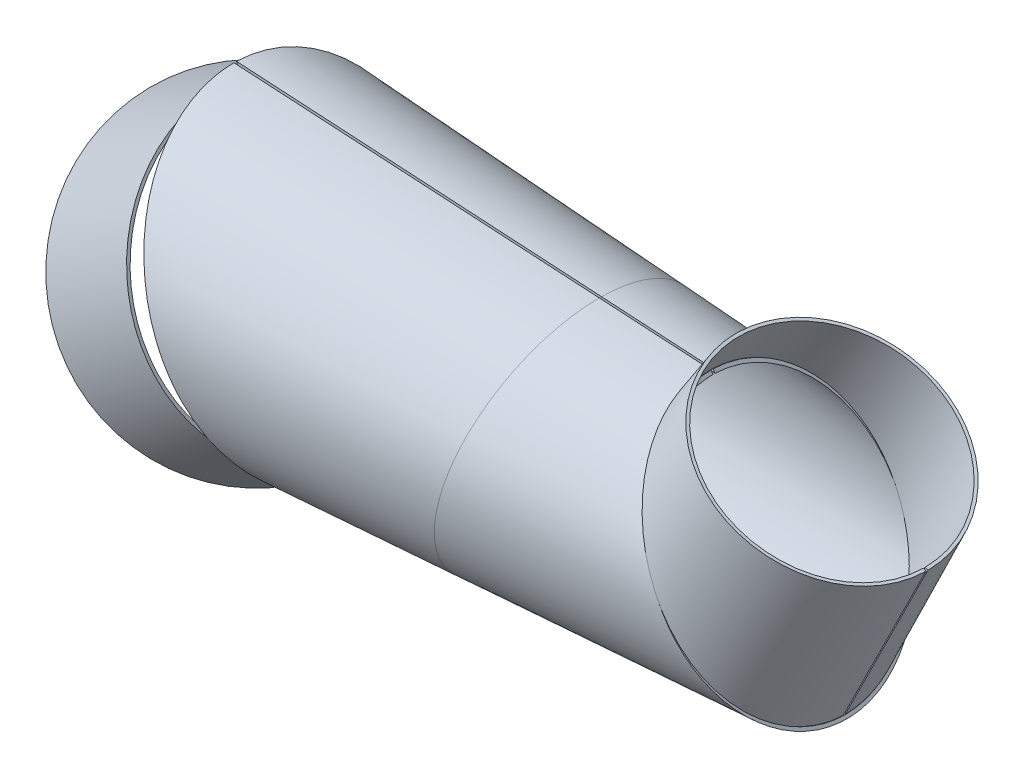
ISO-10303-21;
HEADER;
FILE_DESCRIPTION(('STEP AP214'),'2;1');
FILE_NAME('part.step','',(''),(''),'','','');
FILE_SCHEMA(('AUTOMOTIVE_DESIGN { 1 0 10303 214 1 1 1 1 }'));
ENDSEC;
DATA;
#1=APPLICATION_CONTEXT('core data for automotive mechanical design processes');
#2=APPLICATION_PROTOCOL_DEFINITION('international standard','automotive_design',2000,#1);
#3=PRODUCT_CONTEXT('',#1,'mechanical');
#4=PRODUCT('Part','Part','',(#3));
#5=PRODUCT_RELATED_PRODUCT_CATEGORY('part','',(#4));
#6=PRODUCT_DEFINITION_FORMATION('','',#4);
#7=PRODUCT_DEFINITION_CONTEXT('part definition',#1,'design');
#8=PRODUCT_DEFINITION('design','',#6,#7);
#9=PRODUCT_DEFINITION_SHAPE('','',#8);
#10=(LENGTH_UNIT() NAMED_UNIT(*) SI_UNIT(.MILLI.,.METRE.));
#11=(NAMED_UNIT(*) PLANE_ANGLE_UNIT() SI_UNIT($,.RADIAN.));
#12=(NAMED_UNIT(*) SI_UNIT($,.STERADIAN.) SOLID_ANGLE_UNIT());
#13=UNCERTAINTY_MEASURE_WITH_UNIT(LENGTH_MEASURE(1.E-05),#10,'distance_accuracy_value','');
#14=(GEOMETRIC_REPRESENTATION_CONTEXT(3) GLOBAL_UNCERTAINTY_ASSIGNED_CONTEXT((#13)) GLOBAL_UNIT_ASSIGNED_CONTEXT((#10,
#11,#12)) REPRESENTATION_CONTEXT('',''));
#15=CARTESIAN_POINT('',(0.,0.,0.));
#16=DIRECTION('',(0.,0.,1.));
#17=DIRECTION('',(1.,0.,0.));
#18=AXIS2_PLACEMENT_3D('',#15,#16,#17);
#19=CARTESIAN_POINT('',(252.873344655252,-83.6017692647492,51.3013428607681));
#20=DIRECTION('',(-0.864782222533659,-0.502147097561806,0.));
#21=DIRECTION('',(-0.502147097561806,0.864782222533659,0.));
#22=AXIS2_PLACEMENT_3D('',#19,#20,#21);
#23=PLANE('',#22);
#24=CARTESIAN_POINT('',(202.952192873016,2.37089651247027,-0.0407028410811309));
#25=DIRECTION('',(-0.864782222533659,-0.502147097561806,0.));
#26=DIRECTION('',(0.502147097561806,-0.864782222533659,0.));
#27=AXIS2_PLACEMENT_3D('',#24,#25,#26);
#28=ELLIPSE('',#27,45.8155439953162,39.598352100711);
#29=CARTESIAN_POINT('',(225.958335313478,-37.249571450388,-0.0407028410809806));
#30=VERTEX_POINT('',#29);
#31=CARTESIAN_POINT('',(225.954589177034,-37.2431199699031,0.673866410739601));
#32=VERTEX_POINT('',#31);
#33=EDGE_CURVE('E51',#30,#32,#28,.F.);
#34=ORIENTED_EDGE('',*,*,#33,.F.);
#35=DIRECTION('',(-0.502147097561806,0.864782222533659,0.));
#36=VECTOR('',#35,1.);
#37=CARTESIAN_POINT('',(275.786796245424,-123.062607908006,-0.0407028410806813));
#38=LINE('',#37,#36);
#39=CARTESIAN_POINT('',(225.356609741523,-36.2132982547497,-0.0407028410809841));
#40=VERTEX_POINT('',#39);
#41=EDGE_CURVE('E96',#40,#30,#38,.F.);
#42=ORIENTED_EDGE('',*,*,#41,.F.);
#43=CARTESIAN_POINT('',(202.932740468235,2.4043968431928,-0.0407028410811306));
#44=DIRECTION('',(-0.864782222533659,-0.502147097561806,0.));
#45=DIRECTION('',(0.502147097561806,-0.864782222533659,0.));
#46=AXIS2_PLACEMENT_3D('',#43,#44,#45);
#47=ELLIPSE('',#46,44.6559770676124,38.5961389764437);
#48=CARTESIAN_POINT('',(225.352958417789,-36.2070100577861,0.655781044950861));
#49=VERTEX_POINT('',#48);
#50=EDGE_CURVE('E12',#40,#49,#47,.F.);
#51=ORIENTED_EDGE('',*,*,#50,.T.);
#52=DIRECTION('',(0.502089899252001,-0.864683717371092,0.0150931104290657));
#53=VECTOR('',#52,1.);
#54=CARTESIAN_POINT('',(208.413205270931,-7.03389037504484,0.146562346730605));
#55=LINE('',#54,#53);
#56=EDGE_CURVE('E56',#32,#49,#55,.F.);
#57=ORIENTED_EDGE('',*,*,#56,.F.);
#58=EDGE_LOOP('',(#34,#42,#51,#57));
#59=FACE_BOUND('',#58,.T.);
#60=ADVANCED_FACE('F48',(#59),#23,.T.);
#61=CARTESIAN_POINT('',(253.388914419697,19.0897985581255,0.602345329373929));
#62=DIRECTION('',(-0.0151573410996609,0.00865109826784784,0.999847695156392));
#63=DIRECTION('',(-0.445000523184025,-0.895529747955005,0.00100244380895949));
#64=AXIS2_PLACEMENT_3D('',#61,#62,#63);
#65=PLANE('',#64);
#66=DIRECTION('',(-0.445000523184025,-0.895529747955005,0.00100244380895948));
#67=VECTOR('',#66,1.);
#68=CARTESIAN_POINT('',(-2709.11829160772,-5943.85432651848,7.28564658828967));
#69=LINE('',#68,#67);
#70=CARTESIAN_POINT('',(253.836615433035,18.8673397815923,0.611057125928902));
#71=VERTEX_POINT('',#70);
#72=EDGE_CURVE('E99',#71,#32,#69,.T.);
#73=ORIENTED_EDGE('',*,*,#72,.T.);
#74=ORIENTED_EDGE('',*,*,#56,.T.);
#75=DIRECTION('',(-0.445000523184025,-0.895529747955005,0.00100244380895948));
#76=VECTOR('',#75,1.);
#77=CARTESIAN_POINT('',(-2710.0136936344,-5943.40940896541,7.26822299517971));
#78=LINE('',#77,#76);
#79=CARTESIAN_POINT('',(252.941213406358,19.3122573346585,0.593633532818945));
#80=VERTEX_POINT('',#79);
#81=EDGE_CURVE('E72',#80,#49,#78,.T.);
#82=ORIENTED_EDGE('',*,*,#81,.F.);
#83=DIRECTION('',(0.895402026676695,-0.444917553066189,0.0174235931099559));
#84=VECTOR('',#83,1.);
#85=CARTESIAN_POINT('',(253.388914419697,19.0897985581255,0.602345329373923));
#86=LINE('',#85,#84);
#87=EDGE_CURVE('E106',#80,#71,#86,.T.);
#88=ORIENTED_EDGE('',*,*,#87,.T.);
#89=EDGE_LOOP('',(#73,#74,#82,#88));
#90=FACE_BOUND('',#89,.T.);
#91=ADVANCED_FACE('F120',(#90),#65,.F.);
#92=CARTESIAN_POINT('',(221.393352343052,37.3513623667278,-0.0407028410809843));
#93=DIRECTION('',(0.495696584820509,0.868495766136648,0.));
#94=DIRECTION('',(0.,0.,1.));
#95=AXIS2_PLACEMENT_3D('',#92,#93,#94);
#96=CONICAL_SURFACE('',#95,36.8458168085013,1.51332598057206);
#97=ORIENTED_EDGE('',*,*,#87,.F.);
#98=CARTESIAN_POINT('',(221.379116255485,37.3264197260952,-0.0407028410809845));
#99=DIRECTION('',(-0.495696584820509,-0.868495766136648,0.));
#100=DIRECTION('',(0.,0.,-1.));
#101=AXIS2_PLACEMENT_3D('',#98,#99,#100);
#102=CIRCLE('',#101,36.3466422914344);
#103=CARTESIAN_POINT('',(252.946021198879,19.3095132725385,-0.040702841080782));
#104=VERTEX_POINT('',#103);
#105=EDGE_CURVE('E105',#104,#80,#102,.F.);
#106=ORIENTED_EDGE('',*,*,#105,.F.);
#107=DIRECTION('',(0.895534084405186,-0.444992925414063,0.));
#108=VECTOR('',#107,1.);
#109=CARTESIAN_POINT('',(253.393788241081,19.0870168098315,-0.0407028410807792));
#110=LINE('',#109,#108);
#111=CARTESIAN_POINT('',(253.841555283284,18.8645203471244,-0.0407028410807763));
#112=VERTEX_POINT('',#111);
#113=EDGE_CURVE('E94',#104,#112,#110,.T.);
#114=ORIENTED_EDGE('',*,*,#113,.T.);
#115=CARTESIAN_POINT('',(221.407588430618,37.3763050073604,-0.0407028410809843));
#116=DIRECTION('',(-0.495696584820509,-0.868495766136648,0.));
#117=DIRECTION('',(0.,0.,-1.));
#118=AXIS2_PLACEMENT_3D('',#115,#116,#117);
#119=CIRCLE('',#118,37.3449913255684);
#120=EDGE_CURVE('E104',#112,#71,#119,.F.);
#121=ORIENTED_EDGE('',*,*,#120,.T.);
#122=EDGE_LOOP('',(#97,#106,#114,#121));
#123=FACE_BOUND('',#122,.T.);
#124=ADVANCED_FACE('F103',(#123),#96,.F.);
#125=CARTESIAN_POINT('',(145.032377552514,-198.98686968071,-0.0407028410815574));
#126=DIRECTION('',(0.,0.,-1.));
#127=DIRECTION('',(0.444992925414063,0.895534084405185,0.));
#128=AXIS2_PLACEMENT_3D('',#125,#126,#127);
#129=PLANE('',#128);
#130=DIRECTION('',(-0.444992925414063,-0.895534084405185,0.));
#131=VECTOR('',#130,1.);
#132=CARTESIAN_POINT('',(-2709.95829747486,-5943.44102649098,-0.0407028411020122));
#133=LINE('',#132,#131);
#134=EDGE_CURVE('E64',#40,#104,#133,.F.);
#135=ORIENTED_EDGE('',*,*,#134,.F.);
#136=ORIENTED_EDGE('',*,*,#41,.T.);
#137=DIRECTION('',(-0.444992925414063,-0.895534084405185,0.));
#138=VECTOR('',#137,1.);
#139=CARTESIAN_POINT('',(-2709.06276339045,-5943.8860194164,-0.0407028411020066));
#140=LINE('',#139,#138);
#141=EDGE_CURVE('E91',#30,#112,#140,.F.);
#142=ORIENTED_EDGE('',*,*,#141,.T.);
#143=ORIENTED_EDGE('',*,*,#113,.F.);
#144=EDGE_LOOP('',(#135,#136,#142,#143));
#145=FACE_BOUND('',#144,.T.);
#146=ADVANCED_FACE('F93',(#145),#129,.F.);
#147=CARTESIAN_POINT('',(-3073.67725890508,-5735.84732938244,-0.0407028411042931));
#148=DIRECTION('',(-0.495696584820509,-0.868495766136648,0.));
#149=DIRECTION('',(0.,0.,-1.));
#150=AXIS2_PLACEMENT_3D('',#147,#148,#149);
#151=CONICAL_SURFACE('',#150,418.791864752729,0.0574703462228406);
#152=ORIENTED_EDGE('',*,*,#50,.F.);
#153=ORIENTED_EDGE('',*,*,#134,.T.);
#154=ORIENTED_EDGE('',*,*,#105,.T.);
#155=ORIENTED_EDGE('',*,*,#81,.T.);
#156=EDGE_LOOP('',(#152,#153,#154,#155));
#157=FACE_BOUND('',#156,.T.);
#158=ADVANCED_FACE('F122',(#157),#151,.F.);
#159=CARTESIAN_POINT('',(-3073.64878672994,-5735.79744410118,-0.0407028411042929));
#160=DIRECTION('',(-0.495696584820509,-0.868495766136648,0.));
#161=DIRECTION('',(0.,0.,-1.));
#162=AXIS2_PLACEMENT_3D('',#159,#160,#161);
#163=CONICAL_SURFACE('',#162,419.790213786863,0.0574703462228406);
#164=ORIENTED_EDGE('',*,*,#141,.F.);
#165=ORIENTED_EDGE('',*,*,#33,.T.);
#166=ORIENTED_EDGE('',*,*,#72,.F.);
#167=ORIENTED_EDGE('',*,*,#120,.F.);
#168=EDGE_LOOP('',(#164,#165,#166,#167));
#169=FACE_BOUND('',#168,.T.);
#170=ADVANCED_FACE('F109',(#169),#163,.T.);
#171=CLOSED_SHELL('',(#60,#91,#124,#146,#158,#170));
#172=MANIFOLD_SOLID_BREP('B2',#171);
#173=CARTESIAN_POINT('',(78.127221688215,-70.6374709133356,-37.1809508835221));
#174=DIRECTION('',(-0.898491801711987,-0.438990298590239,0.));
#175=DIRECTION('',(-0.219495149295121,0.449245900855997,0.866025403784436));
#176=AXIS2_PLACEMENT_3D('',#173,#174,#175);
#177=PLANE('',#176);
#178=CARTESIAN_POINT('',(42.5537754579549,2.17154081010065,0.491171663289922));
#179=DIRECTION('',(-0.898491801711987,-0.438990298590239,0.));
#180=DIRECTION('',(0.219495149295121,-0.449245900855997,-0.866025403784436));
#181=AXIS2_PLACEMENT_3D('',#178,#179,#180);
#182=ELLIPSE('',#181,54.3815050083764,48.8420279650165);
#183=CARTESIAN_POINT('',(54.4902520186622,-22.2591273972928,-46.6045931699944));
#184=VERTEX_POINT('',#183);
#185=CARTESIAN_POINT('',(54.8216355056237,-22.9373777987563,-46.1586479087415));
#186=VERTEX_POINT('',#185);
#187=EDGE_CURVE('E196',#184,#186,#182,.F.);
#188=ORIENTED_EDGE('',*,*,#187,.T.);
#189=DIRECTION('',(0.225429827672895,-0.461392547115268,-0.858078265813704));
#190=VECTOR('',#189,1.);
#191=CARTESIAN_POINT('',(29.9443199571217,27.9796108925907,48.5346054389601));
#192=LINE('',#191,#190);
#193=CARTESIAN_POINT('',(54.5630625194989,-22.4081503672556,-45.1744132055963));
#194=VERTEX_POINT('',#193);
#195=EDGE_CURVE('E241',#186,#194,#192,.F.);
#196=ORIENTED_EDGE('',*,*,#195,.T.);
#197=CARTESIAN_POINT('',(42.546891553494,2.18563025977987,0.518332337042092));
#198=DIRECTION('',(-0.898491801711987,-0.438990298590239,0.));
#199=DIRECTION('',(0.219495149295121,-0.449245900855997,-0.866025403784436));
#200=AXIS2_PLACEMENT_3D('',#197,#198,#199);
#201=ELLIPSE('',#200,53.2658066712701,47.8399782907187);
#202=CARTESIAN_POINT('',(54.2384777411299,-21.7438150430764,-45.6112093933478));
#203=VERTEX_POINT('',#202);
#204=EDGE_CURVE('E239',#203,#194,#201,.F.);
#205=ORIENTED_EDGE('',*,*,#204,.F.);
#206=DIRECTION('',(-0.219495149295125,0.449245900856005,0.866025403784431));
#207=VECTOR('',#206,1.);
#208=CARTESIAN_POINT('',(56.4485448625782,-26.2672115651228,-54.3311026456128));
#209=LINE('',#208,#207);
#210=EDGE_CURVE('E226',#203,#184,#209,.F.);
#211=ORIENTED_EDGE('',*,*,#210,.T.);
#212=EDGE_LOOP('',(#188,#196,#205,#211));
#213=FACE_BOUND('',#212,.T.);
#214=ADVANCED_FACE('F192',(#213),#177,.F.);
#215=CARTESIAN_POINT('',(206.066424632484,112.600670151012,49.303357733244));
#216=DIRECTION('',(0.369793240180455,-0.774316956058636,0.513503856925075));
#217=DIRECTION('',(-0.675398364747666,-0.603560787415519,-0.42373508798604));
#218=AXIS2_PLACEMENT_3D('',#215,#216,#217);
#219=PLANE('',#218);
#220=ORIENTED_EDGE('',*,*,#195,.F.);
#221=DIRECTION('',(-0.675398364747666,-0.603560787415519,-0.42373508798604));
#222=VECTOR('',#221,1.);
#223=CARTESIAN_POINT('',(-4290.63151524744,-3906.19393013827,-2772.4326060364));
#224=LINE('',#223,#222);
#225=CARTESIAN_POINT('',(41.917390695909,-34.469084958373,-54.2545829823788));
#226=VERTEX_POINT('',#225);
#227=EDGE_CURVE('E246',#186,#226,#224,.T.);
#228=ORIENTED_EDGE('',*,*,#227,.T.);
#229=DIRECTION('',(0.638036055731193,-0.190125294094307,-0.746165105142645));
#230=VECTOR('',#229,1.);
#231=CARTESIAN_POINT('',(41.5983726680434,-34.3740223113258,-53.8815004298075));
#232=LINE('',#231,#230);
#233=CARTESIAN_POINT('',(41.2793546401778,-34.2789596642787,-53.5084178772361));
#234=VERTEX_POINT('',#233);
#235=EDGE_CURVE('E251',#234,#226,#232,.T.);
#236=ORIENTED_EDGE('',*,*,#235,.F.);
#237=DIRECTION('',(-0.675398364747666,-0.603560787415519,-0.42373508798604));
#238=VECTOR('',#237,1.);
#239=CARTESIAN_POINT('',(-4291.26955130317,-3906.00380484418,-2771.68644093126));
#240=LINE('',#239,#238);
#241=EDGE_CURVE('E46',#194,#234,#240,.T.);
#242=ORIENTED_EDGE('',*,*,#241,.F.);
#243=EDGE_LOOP('',(#220,#228,#236,#242));
#244=FACE_BOUND('',#243,.T.);
#245=ADVANCED_FACE('F262',(#244),#219,.F.);
#246=CARTESIAN_POINT('',(41.265677170798,-33.6853444949624,-54.3311026456128));
#247=DIRECTION('',(-0.380176750594055,0.778116725374627,-0.500000000000013));
#248=DIRECTION('',(0.675774294762727,0.602782614389369,0.424243117007048));
#249=AXIS2_PLACEMENT_3D('',#246,#247,#248);
#250=PLANE('',#249);
#251=ORIENTED_EDGE('',*,*,#210,.F.);
#252=DIRECTION('',(-0.675774294762727,-0.602782614389369,-0.424243117007048));
#253=VECTOR('',#252,1.);
#254=CARTESIAN_POINT('',(-4294.01049755387,-3900.3300614532,-2775.39053526954));
#255=LINE('',#254,#253);
#256=CARTESIAN_POINT('',(40.9499261847165,-33.5970446061145,-53.9536050371197));
#257=VERTEX_POINT('',#256);
#258=EDGE_CURVE('E260',#257,#203,#255,.F.);
#259=ORIENTED_EDGE('',*,*,#258,.F.);
#260=DIRECTION('',(0.631501972162941,-0.176599777695739,-0.754995216986261));
#261=VECTOR('',#260,1.);
#262=CARTESIAN_POINT('',(41.265677170798,-33.6853444949624,-54.3311026456128));
#263=LINE('',#262,#261);
#264=CARTESIAN_POINT('',(41.5814281568795,-33.7736443838103,-54.708600254106));
#265=VERTEX_POINT('',#264);
#266=EDGE_CURVE('E220',#257,#265,#263,.T.);
#267=ORIENTED_EDGE('',*,*,#266,.T.);
#268=DIRECTION('',(-0.675774294762727,-0.602782614389369,-0.424243117007048));
#269=VECTOR('',#268,1.);
#270=CARTESIAN_POINT('',(-4293.37899558171,-3900.5066612309,-2776.14553048652));
#271=LINE('',#270,#269);
#272=EDGE_CURVE('E245',#265,#184,#271,.F.);
#273=ORIENTED_EDGE('',*,*,#272,.T.);
#274=EDGE_LOOP('',(#251,#259,#267,#273));
#275=FACE_BOUND('',#274,.T.);
#276=ADVANCED_FACE('F247',(#275),#250,.F.);
#277=CARTESIAN_POINT('',(-4541.74526299241,-3811.95977552615,-2449.49974399037));
#278=DIRECTION('',(-0.710931276615478,-0.591643776471642,-0.380176750594062));
#279=DIRECTION('',(-0.380176750594062,0.778116725374629,-0.500000000000004));
#280=AXIS2_PLACEMENT_3D('',#277,#278,#279);
#281=CONICAL_SURFACE('',#280,419.790213786863,0.0574703462228406);
#282=ORIENTED_EDGE('',*,*,#187,.F.);
#283=ORIENTED_EDGE('',*,*,#272,.F.);
#284=CARTESIAN_POINT('',(11.2111427838219,-22.9461104526342,-14.766276945802));
#285=DIRECTION('',(-0.710931276615478,-0.591643776471642,-0.380176750594062));
#286=DIRECTION('',(-0.380176750594062,0.778116725374629,-0.500000000000004));
#287=AXIS2_PLACEMENT_3D('',#284,#285,#286);
#288=CIRCLE('',#287,51.3320457018499);
#289=EDGE_CURVE('E248',#226,#265,#288,.T.);
#290=ORIENTED_EDGE('',*,*,#289,.F.);
#291=ORIENTED_EDGE('',*,*,#227,.F.);
#292=EDGE_LOOP('',(#282,#283,#290,#291));
#293=FACE_BOUND('',#292,.T.);
#294=ADVANCED_FACE('F194',(#293),#281,.T.);
#295=CARTESIAN_POINT('',(-4541.78609797178,-3811.99375878473,-2449.52158085461));
#296=DIRECTION('',(-0.710931276615478,-0.591643776471642,-0.380176750594062));
#297=DIRECTION('',(-0.380176750594062,0.778116725374629,-0.500000000000004));
#298=AXIS2_PLACEMENT_3D('',#295,#296,#297);
#299=CONICAL_SURFACE('',#298,418.791864752729,0.0574703462228406);
#300=ORIENTED_EDGE('',*,*,#258,.T.);
#301=ORIENTED_EDGE('',*,*,#204,.T.);
#302=ORIENTED_EDGE('',*,*,#241,.T.);
#303=CARTESIAN_POINT('',(11.1703078044506,-22.9800937112164,-14.7881138100371));
#304=DIRECTION('',(-0.710931276615478,-0.591643776471642,-0.380176750594062));
#305=DIRECTION('',(-0.380176750594062,0.778116725374629,-0.500000000000004));
#306=AXIS2_PLACEMENT_3D('',#303,#304,#305);
#307=CIRCLE('',#306,50.3336966677159);
#308=EDGE_CURVE('E202',#234,#257,#307,.T.);
#309=ORIENTED_EDGE('',*,*,#308,.T.);
#310=EDGE_LOOP('',(#300,#301,#302,#309));
#311=FACE_BOUND('',#310,.T.);
#312=ADVANCED_FACE('F266',(#311),#299,.F.);
#313=CARTESIAN_POINT('',(11.1907252941363,-22.9631020819253,-14.7771953779196));
#314=DIRECTION('',(0.710931276615478,0.591643776471642,0.380176750594062));
#315=DIRECTION('',(0.380176750594062,-0.778116725374629,0.500000000000004));
#316=AXIS2_PLACEMENT_3D('',#313,#314,#315);
#317=CONICAL_SURFACE('',#316,50.8328711847828,1.51332598057206);
#318=ORIENTED_EDGE('',*,*,#308,.F.);
#319=ORIENTED_EDGE('',*,*,#235,.T.);
#320=ORIENTED_EDGE('',*,*,#289,.T.);
#321=ORIENTED_EDGE('',*,*,#266,.F.);
#322=EDGE_LOOP('',(#318,#319,#320,#321));
#323=FACE_BOUND('',#322,.T.);
#324=ADVANCED_FACE('F265',(#323),#317,.T.);
#325=CLOSED_SHELL('',(#214,#245,#276,#294,#312,#324));
#326=MANIFOLD_SOLID_BREP('B6',#325);
#327=CARTESIAN_POINT('',(10.8348988902947,67.0913138599332,-51.3420457018499));
#328=DIRECTION('',(-0.898491801711987,-0.438990298590239,0.));
#329=DIRECTION('',(0.438990298590239,-0.898491801711987,0.));
#330=AXIS2_PLACEMENT_3D('',#327,#328,#329);
#331=PLANE('',#330);
#332=CARTESIAN_POINT('',(42.943687143254,1.37349936417808,0.));
#333=DIRECTION('',(-0.898491801711987,-0.438990298590239,0.));
#334=DIRECTION('',(-0.438990298590239,0.898491801711987,0.));
#335=AXIS2_PLACEMENT_3D('',#332,#333,#334);
#336=ELLIPSE('',#335,54.3815050083764,48.8420279650165);
#337=CARTESIAN_POINT('',(19.0707340218403,50.2348357789638,-5.76951465186599E-13));
#338=VERTEX_POINT('',#337);
#339=CARTESIAN_POINT('',(19.0745802987258,50.2269635133132,-0.876714909271383));
#340=VERTEX_POINT('',#339);
#341=EDGE_CURVE('E339',#338,#340,#336,.F.);
#342=ORIENTED_EDGE('',*,*,#341,.F.);
#343=DIRECTION('',(0.438990298590239,-0.898491801711987,0.));
#344=VECTOR('',#343,1.);
#345=CARTESIAN_POINT('',(15.1541483340065,58.2510041146225,-6.71958617512262E-13));
#346=LINE('',#345,#344);
#347=CARTESIAN_POINT('',(19.5742825769047,49.204211070531,-5.65114650626198E-13));
#348=VERTEX_POINT('',#347);
#349=EDGE_CURVE('E379',#348,#338,#346,.F.);
#350=ORIENTED_EDGE('',*,*,#349,.F.);
#351=CARTESIAN_POINT('',(42.9574549521752,1.34532046481928,0.));
#352=DIRECTION('',(-0.898491801711987,-0.438990298590239,0.));
#353=DIRECTION('',(-0.438990298590239,0.898491801711987,0.));
#354=AXIS2_PLACEMENT_3D('',#351,#352,#353);
#355=ELLIPSE('',#354,53.2658066712701,47.8399782907187);
#356=CARTESIAN_POINT('',(19.5780499430509,49.196500313351,-0.858728107209918));
#357=VERTEX_POINT('',#356);
#358=EDGE_CURVE('E388',#348,#357,#355,.F.);
#359=ORIENTED_EDGE('',*,*,#358,.T.);
#360=DIRECTION('',(-0.43893632068889,0.898381323867736,-0.0156813043383967));
#361=VECTOR('',#360,1.);
#362=CARTESIAN_POINT('',(67.5134114338851,-48.9139350423449,0.853795912058053));
#363=LINE('',#362,#361);
#364=EDGE_CURVE('E391',#340,#357,#363,.F.);
#365=ORIENTED_EDGE('',*,*,#364,.F.);
#366=EDGE_LOOP('',(#342,#350,#359,#365));
#367=FACE_BOUND('',#366,.T.);
#368=ADVANCED_FACE('F335',(#367),#331,.T.);
#369=CARTESIAN_POINT('',(102.346433553855,-120.207503269597,-51.3420457018499));
#370=DIRECTION('',(0.97078111988904,-0.239966700329404,0.));
#371=DIRECTION('',(0.239966700329404,0.97078111988904,0.));
#372=AXIS2_PLACEMENT_3D('',#369,#370,#371);
#373=PLANE('',#372);
#374=CARTESIAN_POINT('',(131.90666503997,-0.622100016230975,0.));
#375=DIRECTION('',(0.97078111988904,-0.239966700329404,0.));
#376=DIRECTION('',(-0.239966700329404,-0.97078111988904,0.));
#377=AXIS2_PLACEMENT_3D('',#374,#375,#376);
#378=ELLIPSE('',#377,45.0595567669498,43.7385430916082);
#379=CARTESIAN_POINT('',(142.717857536422,43.1143915246175,-0.752564503402178));
#380=VERTEX_POINT('',#379);
#381=CARTESIAN_POINT('',(142.71945819564,43.1208669636927,-4.95246913601678E-13));
#382=VERTEX_POINT('',#381);
#383=EDGE_CURVE('E359',#380,#382,#378,.F.);
#384=ORIENTED_EDGE('',*,*,#383,.F.);
#385=DIRECTION('',(-0.239932256371424,-0.970641777455047,0.0169426152475046));
#386=VECTOR('',#385,1.);
#387=CARTESIAN_POINT('',(147.033934181069,60.5750046549546,-1.05734063927846));
#388=LINE('',#387,#386);
#389=CARTESIAN_POINT('',(142.47376801903,42.1269316198793,-0.735328326650975));
#390=VERTEX_POINT('',#389);
#391=EDGE_CURVE('E389',#390,#380,#388,.F.);
#392=ORIENTED_EDGE('',*,*,#391,.F.);
#393=CARTESIAN_POINT('',(131.910187021549,-0.607851900902512,0.));
#394=DIRECTION('',(0.97078111988904,-0.239966700329404,0.));
#395=DIRECTION('',(-0.239966700329404,-0.97078111988904,0.));
#396=AXIS2_PLACEMENT_3D('',#393,#394,#395);
#397=ELLIPSE('',#396,44.0275462465824,42.736788084351);
#398=CARTESIAN_POINT('',(142.475332017942,42.1332587503219,-4.83904147234495E-13));
#399=VERTEX_POINT('',#398);
#400=EDGE_CURVE('E392',#390,#399,#397,.F.);
#401=ORIENTED_EDGE('',*,*,#400,.T.);
#402=DIRECTION('',(0.239966700329404,0.97078111988904,0.));
#403=VECTOR('',#402,1.);
#404=CARTESIAN_POINT('',(136.295995713636,17.1348610166706,-1.97518853033954E-13));
#405=LINE('',#404,#403);
#406=EDGE_CURVE('E380',#382,#399,#405,.F.);
#407=ORIENTED_EDGE('',*,*,#406,.F.);
#408=EDGE_LOOP('',(#384,#392,#401,#407));
#409=FACE_BOUND('',#408,.T.);
#410=ADVANCED_FACE('F415',(#409),#373,.T.);
#411=CARTESIAN_POINT('',(243.081908968881,36.8402050121347,-0.643048170455136));
#412=DIRECTION('',(0.,-0.0174524064372693,-0.999847695156391));
#413=DIRECTION('',(-0.998349034134002,0.0574299673525483,-0.00100244380896333));
#414=AXIS2_PLACEMENT_3D('',#411,#412,#413);
#415=PLANE('',#414);
#416=DIRECTION('',(-0.998349034134002,0.0574299673525483,-0.00100244380896333));
#417=VECTOR('',#416,1.);
#418=CARTESIAN_POINT('',(-6404.21452190349,419.726277704004,-7.3263494293965));
#419=LINE('',#418,#417);
#420=EDGE_CURVE('E385',#380,#340,#419,.T.);
#421=ORIENTED_EDGE('',*,*,#420,.T.);
#422=ORIENTED_EDGE('',*,*,#364,.T.);
#423=DIRECTION('',(-0.998349034134002,0.0574299673525483,-0.00100244380896333));
#424=VECTOR('',#423,1.);
#425=CARTESIAN_POINT('',(-6404.27196061904,418.728080723264,-7.30892583628653));
#426=LINE('',#425,#424);
#427=EDGE_CURVE('E190',#390,#357,#426,.T.);
#428=ORIENTED_EDGE('',*,*,#427,.F.);
#429=ORIENTED_EDGE('',*,*,#391,.T.);
#430=EDGE_LOOP('',(#421,#422,#428,#429));
#431=FACE_BOUND('',#430,.T.);
#432=ADVANCED_FACE('F406',(#431),#415,.F.);
#433=CARTESIAN_POINT('',(-0.0287193577737099,50.8328711847828,-5.86360675319158E-13));
#434=DIRECTION('',(0.,0.,1.));
#435=DIRECTION('',(0.998349034134002,-0.0574387155471368,0.));
#436=AXIS2_PLACEMENT_3D('',#433,#434,#435);
#437=PLANE('',#436);
#438=DIRECTION('',(-0.998349034134002,0.0574387155471368,0.));
#439=VECTOR('',#438,1.);
#440=CARTESIAN_POINT('',(-6404.27196061904,418.791864752729,-4.8098610502176E-12));
#441=LINE('',#440,#439);
#442=EDGE_CURVE('E344',#348,#399,#441,.F.);
#443=ORIENTED_EDGE('',*,*,#442,.F.);
#444=ORIENTED_EDGE('',*,*,#349,.T.);
#445=DIRECTION('',(-0.998349034134002,0.0574387155471368,0.));
#446=VECTOR('',#445,1.);
#447=CARTESIAN_POINT('',(-6404.21452190349,419.790213786863,-4.82132717584695E-12));
#448=LINE('',#447,#446);
#449=EDGE_CURVE('E397',#338,#382,#448,.F.);
#450=ORIENTED_EDGE('',*,*,#449,.T.);
#451=ORIENTED_EDGE('',*,*,#406,.T.);
#452=EDGE_LOOP('',(#443,#444,#450,#451));
#453=FACE_BOUND('',#452,.T.);
#454=ADVANCED_FACE('F377',(#453),#437,.F.);
#455=CARTESIAN_POINT('',(-6404.27196061904,0.,0.));
#456=DIRECTION('',(-1.,0.,0.));
#457=DIRECTION('',(0.,0.,1.));
#458=AXIS2_PLACEMENT_3D('',#455,#456,#457);
#459=CONICAL_SURFACE('',#458,418.791864752729,0.0574703462228406);
#460=ORIENTED_EDGE('',*,*,#358,.F.);
#461=ORIENTED_EDGE('',*,*,#442,.T.);
#462=ORIENTED_EDGE('',*,*,#400,.F.);
#463=ORIENTED_EDGE('',*,*,#427,.T.);
#464=EDGE_LOOP('',(#460,#461,#462,#463));
#465=FACE_BOUND('',#464,.T.);
#466=ADVANCED_FACE('F337',(#465),#459,.F.);
#467=CARTESIAN_POINT('',(-6404.21452190349,0.,0.));
#468=DIRECTION('',(-1.,0.,0.));
#469=DIRECTION('',(0.,0.,1.));
#470=AXIS2_PLACEMENT_3D('',#467,#468,#469);
#471=CONICAL_SURFACE('',#470,419.790213786863,0.0574703462228406);
#472=ORIENTED_EDGE('',*,*,#449,.F.);
#473=ORIENTED_EDGE('',*,*,#341,.T.);
#474=ORIENTED_EDGE('',*,*,#420,.F.);
#475=ORIENTED_EDGE('',*,*,#383,.T.);
#476=EDGE_LOOP('',(#472,#473,#474,#475));
#477=FACE_BOUND('',#476,.T.);
#478=ADVANCED_FACE('F408',(#477),#471,.T.);
#479=CLOSED_SHELL('',(#368,#410,#432,#454,#466,#478));
#480=MANIFOLD_SOLID_BREP('B40',#479);
#481=CARTESIAN_POINT('',(102.346433553855,-120.207503269597,-51.3420457018499));
#482=DIRECTION('',(0.97078111988904,-0.239966700329404,0.));
#483=DIRECTION('',(0.239966700329404,0.97078111988904,0.));
#484=AXIS2_PLACEMENT_3D('',#481,#482,#483);
#485=PLANE('',#484);
#486=CARTESIAN_POINT('',(131.90666503997,-0.622100016230975,0.));
#487=DIRECTION('',(0.97078111988904,-0.239966700329404,0.));
#488=DIRECTION('',(-0.239966700329404,-0.97078111988904,0.));
#489=AXIS2_PLACEMENT_3D('',#486,#487,#488);
#490=ELLIPSE('',#489,45.0595567669498,43.7385430916082);
#491=CARTESIAN_POINT('',(142.717857536422,43.1143915246175,-0.752564503402178));
#492=VERTEX_POINT('',#491);
#493=CARTESIAN_POINT('',(142.71945819564,43.1208669636927,-4.95246913601678E-13));
#494=VERTEX_POINT('',#493);
#495=EDGE_CURVE('E471',#492,#494,#490,.F.);
#496=ORIENTED_EDGE('',*,*,#495,.T.);
#497=DIRECTION('',(0.239966700329404,0.97078111988904,0.));
#498=VECTOR('',#497,1.);
#499=CARTESIAN_POINT('',(136.295995713636,17.1348610166706,-1.97518853033954E-13));
#500=LINE('',#499,#498);
#501=CARTESIAN_POINT('',(142.475332017942,42.1332587503219,-4.83904147234495E-13));
#502=VERTEX_POINT('',#501);
#503=EDGE_CURVE('E509',#494,#502,#500,.F.);
#504=ORIENTED_EDGE('',*,*,#503,.T.);
#505=CARTESIAN_POINT('',(131.910187021549,-0.607851900902512,0.));
#506=DIRECTION('',(0.97078111988904,-0.239966700329404,0.));
#507=DIRECTION('',(-0.239966700329404,-0.97078111988904,0.));
#508=AXIS2_PLACEMENT_3D('',#505,#506,#507);
#509=ELLIPSE('',#508,44.0275462465824,42.736788084351);
#510=CARTESIAN_POINT('',(142.47376801903,42.1269316198793,-0.735328326650975));
#511=VERTEX_POINT('',#510);
#512=EDGE_CURVE('E483',#511,#502,#509,.F.);
#513=ORIENTED_EDGE('',*,*,#512,.F.);
#514=DIRECTION('',(-0.239932256371424,-0.970641777455047,0.0169426152475046));
#515=VECTOR('',#514,1.);
#516=CARTESIAN_POINT('',(147.033934181069,60.5750046549546,-1.05734063927846));
#517=LINE('',#516,#515);
#518=EDGE_CURVE('E517',#511,#492,#517,.F.);
#519=ORIENTED_EDGE('',*,*,#518,.T.);
#520=EDGE_LOOP('',(#496,#504,#513,#519));
#521=FACE_BOUND('',#520,.T.);
#522=ADVANCED_FACE('F467',(#521),#485,.F.);
#523=CARTESIAN_POINT('',(153.639150925308,87.2962943142284,-51.3420457018499));
#524=DIRECTION('',(-0.864782222533659,-0.502147097561806,0.));
#525=DIRECTION('',(0.502147097561806,-0.864782222533659,0.));
#526=AXIS2_PLACEMENT_3D('',#523,#524,#525);
#527=PLANE('',#526);
#528=CARTESIAN_POINT('',(203.560302707543,1.32362853700885,0.));
#529=DIRECTION('',(-0.864782222533659,-0.502147097561806,0.));
#530=DIRECTION('',(-0.502147097561806,0.864782222533659,0.));
#531=AXIS2_PLACEMENT_3D('',#528,#529,#530);
#532=ELLIPSE('',#531,45.8155439953162,39.598352100711);
#533=CARTESIAN_POINT('',(180.55416026708,40.9440964998668,-4.70246515192786E-13));
#534=VERTEX_POINT('',#533);
#535=CARTESIAN_POINT('',(180.557906403524,40.9376450193819,-0.714569251821052));
#536=VERTEX_POINT('',#535);
#537=EDGE_CURVE('E521',#534,#536,#532,.F.);
#538=ORIENTED_EDGE('',*,*,#537,.T.);
#539=DIRECTION('',(-0.502089899252001,0.864683717371092,-0.0150931104290727));
#540=VECTOR('',#539,1.);
#541=CARTESIAN_POINT('',(198.099290309628,10.7284154245243,-0.187265187811812));
#542=LINE('',#541,#540);
#543=CARTESIAN_POINT('',(181.15953716277,39.9015351072655,-0.696483886032303));
#544=VERTEX_POINT('',#543);
#545=EDGE_CURVE('E515',#536,#544,#542,.F.);
#546=ORIENTED_EDGE('',*,*,#545,.T.);
#547=CARTESIAN_POINT('',(203.579755112324,1.29012820628605,0.));
#548=DIRECTION('',(-0.864782222533659,-0.502147097561806,0.));
#549=DIRECTION('',(-0.502147097561806,0.864782222533659,0.));
#550=AXIS2_PLACEMENT_3D('',#547,#548,#549);
#551=ELLIPSE('',#550,44.6559770676124,38.5961389764437);
#552=CARTESIAN_POINT('',(181.155885839035,39.9078233042279,-4.5834482726475E-13));
#553=VERTEX_POINT('',#552);
#554=EDGE_CURVE('E525',#553,#544,#551,.F.);
#555=ORIENTED_EDGE('',*,*,#554,.F.);
#556=DIRECTION('',(0.502147097561806,-0.864782222533659,0.));
#557=VECTOR('',#556,1.);
#558=CARTESIAN_POINT('',(130.725699335136,126.757132957486,-1.4624518200507E-12));
#559=LINE('',#558,#557);
#560=EDGE_CURVE('E491',#553,#534,#559,.F.);
#561=ORIENTED_EDGE('',*,*,#560,.T.);
#562=EDGE_LOOP('',(#538,#546,#555,#561));
#563=FACE_BOUND('',#562,.T.);
#564=ADVANCED_FACE('F539',(#563),#527,.F.);
#565=CARTESIAN_POINT('',(-0.0287193577737099,50.8328711847828,-5.86360675319158E-13));
#566=DIRECTION('',(0.,0.,1.));
#567=DIRECTION('',(0.998349034134002,-0.0574387155471368,0.));
#568=AXIS2_PLACEMENT_3D('',#565,#566,#567);
#569=PLANE('',#568);
#570=ORIENTED_EDGE('',*,*,#503,.F.);
#571=DIRECTION('',(-0.998349034134002,0.0574387155471368,0.));
#572=VECTOR('',#571,1.);
#573=CARTESIAN_POINT('',(-6404.21452190349,419.790213786863,-4.82132717584695E-12));
#574=LINE('',#573,#572);
#575=EDGE_CURVE('E513',#494,#534,#574,.F.);
#576=ORIENTED_EDGE('',*,*,#575,.T.);
#577=ORIENTED_EDGE('',*,*,#560,.F.);
#578=DIRECTION('',(-0.998349034134002,0.0574387155471368,0.));
#579=VECTOR('',#578,1.);
#580=CARTESIAN_POINT('',(-6404.27196061904,418.791864752729,-4.8098610502176E-12));
#581=LINE('',#580,#579);
#582=EDGE_CURVE('E476',#502,#553,#581,.F.);
#583=ORIENTED_EDGE('',*,*,#582,.F.);
#584=EDGE_LOOP('',(#570,#576,#577,#583));
#585=FACE_BOUND('',#584,.T.);
#586=ADVANCED_FACE('F511',(#585),#569,.F.);
#587=CARTESIAN_POINT('',(243.081908968881,36.8402050121347,-0.643048170455136));
#588=DIRECTION('',(0.,-0.0174524064372693,-0.999847695156391));
#589=DIRECTION('',(-0.998349034134002,0.0574299673525483,-0.00100244380896333));
#590=AXIS2_PLACEMENT_3D('',#587,#588,#589);
#591=PLANE('',#590);
#592=ORIENTED_EDGE('',*,*,#518,.F.);
#593=DIRECTION('',(-0.998349034134002,0.0574299673525483,-0.00100244380896333));
#594=VECTOR('',#593,1.);
#595=CARTESIAN_POINT('',(-6404.27196061904,418.728080723264,-7.30892583628653));
#596=LINE('',#595,#594);
#597=EDGE_CURVE('E333',#544,#511,#596,.T.);
#598=ORIENTED_EDGE('',*,*,#597,.F.);
#599=ORIENTED_EDGE('',*,*,#545,.F.);
#600=DIRECTION('',(-0.998349034134002,0.0574299673525483,-0.00100244380896333));
#601=VECTOR('',#600,1.);
#602=CARTESIAN_POINT('',(-6404.21452190349,419.726277704004,-7.3263494293965));
#603=LINE('',#602,#601);
#604=EDGE_CURVE('E524',#536,#492,#603,.T.);
#605=ORIENTED_EDGE('',*,*,#604,.T.);
#606=EDGE_LOOP('',(#592,#598,#599,#605));
#607=FACE_BOUND('',#606,.T.);
#608=ADVANCED_FACE('F541',(#607),#591,.F.);
#609=CARTESIAN_POINT('',(-6404.27196061904,0.,0.));
#610=DIRECTION('',(-1.,0.,0.));
#611=DIRECTION('',(0.,0.,1.));
#612=AXIS2_PLACEMENT_3D('',#609,#610,#611);
#613=CONICAL_SURFACE('',#612,418.791864752729,0.0574703462228406);
#614=ORIENTED_EDGE('',*,*,#597,.T.);
#615=ORIENTED_EDGE('',*,*,#512,.T.);
#616=ORIENTED_EDGE('',*,*,#582,.T.);
#617=ORIENTED_EDGE('',*,*,#554,.T.);
#618=EDGE_LOOP('',(#614,#615,#616,#617));
#619=FACE_BOUND('',#618,.T.);
#620=ADVANCED_FACE('F538',(#619),#613,.F.);
#621=CARTESIAN_POINT('',(-6404.21452190349,0.,0.));
#622=DIRECTION('',(-1.,0.,0.));
#623=DIRECTION('',(0.,0.,1.));
#624=AXIS2_PLACEMENT_3D('',#621,#622,#623);
#625=CONICAL_SURFACE('',#624,419.790213786863,0.0574703462228406);
#626=ORIENTED_EDGE('',*,*,#495,.F.);
#627=ORIENTED_EDGE('',*,*,#604,.F.);
#628=ORIENTED_EDGE('',*,*,#537,.F.);
#629=ORIENTED_EDGE('',*,*,#575,.F.);
#630=EDGE_LOOP('',(#626,#627,#628,#629));
#631=FACE_BOUND('',#630,.T.);
#632=ADVANCED_FACE('F469',(#631),#625,.T.);
#633=CLOSED_SHELL('',(#522,#564,#586,#608,#620,#632));
#634=MANIFOLD_SOLID_BREP('B184',#633);
#635=ADVANCED_BREP_SHAPE_REPRESENTATION('',(#18,#172,#326,#480,#634),#14);
#636=SHAPE_DEFINITION_REPRESENTATION(#9,#635);
ENDSEC;
END-ISO-10303-21;
